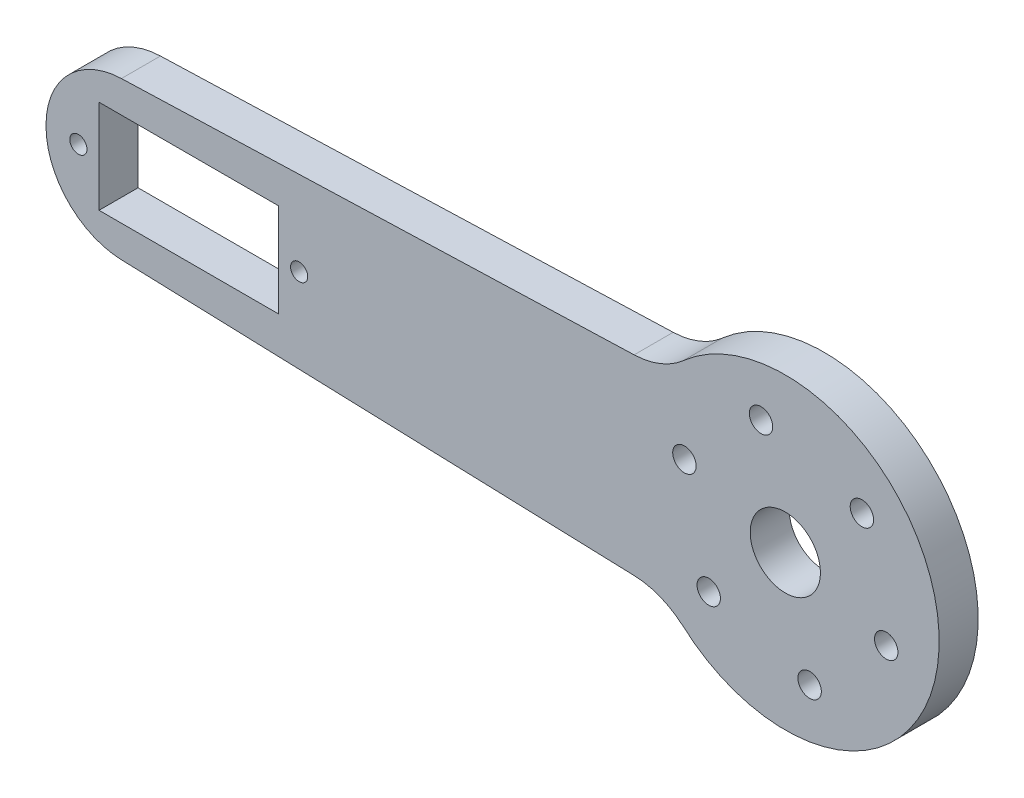
ISO-10303-21;
HEADER;
FILE_DESCRIPTION(('STEP AP214'),'2;1');
FILE_NAME('part.step','',(''),(''),'','','');
FILE_SCHEMA(('AUTOMOTIVE_DESIGN { 1 0 10303 214 1 1 1 1 }'));
ENDSEC;
DATA;
#1=APPLICATION_CONTEXT('core data for automotive mechanical design processes');
#2=APPLICATION_PROTOCOL_DEFINITION('international standard','automotive_design',2000,#1);
#3=PRODUCT_CONTEXT('',#1,'mechanical');
#4=PRODUCT('Part','Part','',(#3));
#5=PRODUCT_RELATED_PRODUCT_CATEGORY('part','',(#4));
#6=PRODUCT_DEFINITION_FORMATION('','',#4);
#7=PRODUCT_DEFINITION_CONTEXT('part definition',#1,'design');
#8=PRODUCT_DEFINITION('design','',#6,#7);
#9=PRODUCT_DEFINITION_SHAPE('','',#8);
#10=(LENGTH_UNIT() NAMED_UNIT(*) SI_UNIT(.MILLI.,.METRE.));
#11=(NAMED_UNIT(*) PLANE_ANGLE_UNIT() SI_UNIT($,.RADIAN.));
#12=(NAMED_UNIT(*) SI_UNIT($,.STERADIAN.) SOLID_ANGLE_UNIT());
#13=UNCERTAINTY_MEASURE_WITH_UNIT(LENGTH_MEASURE(1.E-05),#10,'distance_accuracy_value','');
#14=(GEOMETRIC_REPRESENTATION_CONTEXT(3) GLOBAL_UNCERTAINTY_ASSIGNED_CONTEXT((#13)) GLOBAL_UNIT_ASSIGNED_CONTEXT((#10,
#11,#12)) REPRESENTATION_CONTEXT('',''));
#15=CARTESIAN_POINT('',(0.,0.,0.));
#16=DIRECTION('',(0.,0.,1.));
#17=DIRECTION('',(1.,0.,0.));
#18=AXIS2_PLACEMENT_3D('',#15,#16,#17);
#19=CARTESIAN_POINT('',(0.,0.,5.));
#20=DIRECTION('',(0.,0.,1.));
#21=DIRECTION('',(1.,0.,0.));
#22=AXIS2_PLACEMENT_3D('',#19,#20,#21);
#23=PLANE('',#22);
#24=CARTESIAN_POINT('',(-46.8297385620915,0.,5.));
#25=DIRECTION('',(0.,0.,1.));
#26=DIRECTION('',(1.,0.,0.));
#27=AXIS2_PLACEMENT_3D('',#24,#25,#26);
#28=CIRCLE('',#27,1.1);
#29=CARTESIAN_POINT('',(-45.7297385620915,0.,5.));
#30=VERTEX_POINT('',#29);
#31=EDGE_CURVE('E291',#30,#30,#28,.T.);
#32=ORIENTED_EDGE('',*,*,#31,.F.);
#33=EDGE_LOOP('',(#32));
#34=FACE_BOUND('',#33,.T.);
#35=CARTESIAN_POINT('',(-18.5297385620915,0.,5.));
#36=DIRECTION('',(0.,0.,1.));
#37=DIRECTION('',(-1.,0.,0.));
#38=AXIS2_PLACEMENT_3D('',#35,#36,#37);
#39=CIRCLE('',#38,1.1);
#40=CARTESIAN_POINT('',(-19.6297385620915,0.,5.));
#41=VERTEX_POINT('',#40);
#42=EDGE_CURVE('E300',#41,#41,#39,.T.);
#43=ORIENTED_EDGE('',*,*,#42,.F.);
#44=EDGE_LOOP('',(#43));
#45=FACE_BOUND('',#44,.T.);
#46=CARTESIAN_POINT('',(56.7245945855578,-3.86888130370243,5.));
#47=DIRECTION('',(0.,0.,1.));
#48=DIRECTION('',(1.,0.,0.));
#49=AXIS2_PLACEMENT_3D('',#46,#47,#48);
#50=CIRCLE('',#49,1.50000000000001);
#51=CARTESIAN_POINT('',(58.2245945855578,-3.86888130370243,5.));
#52=VERTEX_POINT('',#51);
#53=EDGE_CURVE('E317',#52,#52,#50,.T.);
#54=ORIENTED_EDGE('',*,*,#53,.F.);
#55=EDGE_LOOP('',(#54));
#56=FACE_BOUND('',#55,.T.);
#57=CARTESIAN_POINT('',(46.9071726361478,-13.1353923120184,5.));
#58=DIRECTION('',(0.,0.,1.));
#59=DIRECTION('',(1.,0.,0.));
#60=AXIS2_PLACEMENT_3D('',#57,#58,#59);
#61=CIRCLE('',#60,1.50000000000001);
#62=CARTESIAN_POINT('',(48.4071726361478,-13.1353923120184,5.));
#63=VERTEX_POINT('',#62);
#64=EDGE_CURVE('E321',#63,#63,#61,.T.);
#65=ORIENTED_EDGE('',*,*,#64,.F.);
#66=EDGE_LOOP('',(#65));
#67=FACE_BOUND('',#66,.T.);
#68=CARTESIAN_POINT('',(33.9734277237929,-9.26651100831639,5.));
#69=DIRECTION('',(0.,0.,1.));
#70=DIRECTION('',(1.,0.,0.));
#71=AXIS2_PLACEMENT_3D('',#68,#69,#70);
#72=CIRCLE('',#71,1.50000000000001);
#73=CARTESIAN_POINT('',(35.4734277237929,-9.26651100831639,5.));
#74=VERTEX_POINT('',#73);
#75=EDGE_CURVE('E313',#74,#74,#72,.T.);
#76=ORIENTED_EDGE('',*,*,#75,.F.);
#77=EDGE_LOOP('',(#76));
#78=FACE_BOUND('',#77,.T.);
#79=CARTESIAN_POINT('',(30.8571047608481,3.86888130370171,5.));
#80=DIRECTION('',(0.,0.,1.));
#81=DIRECTION('',(1.,0.,0.));
#82=AXIS2_PLACEMENT_3D('',#79,#80,#81);
#83=CIRCLE('',#82,1.49999999999999);
#84=CARTESIAN_POINT('',(32.3571047608481,3.86888130370171,5.));
#85=VERTEX_POINT('',#84);
#86=EDGE_CURVE('E309',#85,#85,#83,.T.);
#87=ORIENTED_EDGE('',*,*,#86,.F.);
#88=EDGE_LOOP('',(#87));
#89=FACE_BOUND('',#88,.T.);
#90=CARTESIAN_POINT('',(40.6745267102583,13.1353923120177,5.));
#91=DIRECTION('',(0.,0.,1.));
#92=DIRECTION('',(1.,0.,0.));
#93=AXIS2_PLACEMENT_3D('',#90,#91,#92);
#94=CIRCLE('',#93,1.50000000000001);
#95=CARTESIAN_POINT('',(42.1745267102583,13.1353923120177,5.));
#96=VERTEX_POINT('',#95);
#97=EDGE_CURVE('E298',#96,#96,#94,.T.);
#98=ORIENTED_EDGE('',*,*,#97,.F.);
#99=EDGE_LOOP('',(#98));
#100=FACE_BOUND('',#99,.T.);
#101=CARTESIAN_POINT('',(53.608271622613,9.26651100831564,5.));
#102=DIRECTION('',(0.,0.,1.));
#103=DIRECTION('',(1.,0.,0.));
#104=AXIS2_PLACEMENT_3D('',#101,#102,#103);
#105=CIRCLE('',#104,1.5);
#106=CARTESIAN_POINT('',(55.108271622613,9.26651100831564,5.));
#107=VERTEX_POINT('',#106);
#108=EDGE_CURVE('E269',#107,#107,#105,.T.);
#109=ORIENTED_EDGE('',*,*,#108,.F.);
#110=EDGE_LOOP('',(#109));
#111=FACE_BOUND('',#110,.T.);
#112=CARTESIAN_POINT('',(43.7908496732026,0.,5.));
#113=DIRECTION('',(0.,0.,1.));
#114=DIRECTION('',(1.,0.,0.));
#115=AXIS2_PLACEMENT_3D('',#112,#113,#114);
#116=CIRCLE('',#115,4.5);
#117=CARTESIAN_POINT('',(48.2908496732026,0.,5.));
#118=VERTEX_POINT('',#117);
#119=EDGE_CURVE('E263',#118,#118,#116,.T.);
#120=ORIENTED_EDGE('',*,*,#119,.F.);
#121=EDGE_LOOP('',(#120));
#122=FACE_BOUND('',#121,.T.);
#123=DIRECTION('',(-0.999444906979154,-0.0333148302326385,0.));
#124=VECTOR('',#123,1.);
#125=CARTESIAN_POINT('',(49.0196078431373,13.0718954248366,5.));
#126=LINE('',#125,#124);
#127=CARTESIAN_POINT('',(24.4128324046,12.2516695768854,5.));
#128=VERTEX_POINT('',#127);
#129=CARTESIAN_POINT('',(-41.3135404591891,10.0607904814257,5.));
#130=VERTEX_POINT('',#129);
#131=EDGE_CURVE('E199',#128,#130,#126,.T.);
#132=ORIENTED_EDGE('',*,*,#131,.T.);
#133=CARTESIAN_POINT('',(-40.9803921568627,0.0663414116341774,5.));
#134=DIRECTION('',(0.,0.,1.));
#135=DIRECTION('',(1.,0.,0.));
#136=AXIS2_PLACEMENT_3D('',#133,#134,#135);
#137=CIRCLE('',#136,10.);
#138=CARTESIAN_POINT('',(-50.9803921568627,0.0663414116341774,5.));
#139=VERTEX_POINT('',#138);
#140=EDGE_CURVE('E233',#130,#139,#137,.T.);
#141=ORIENTED_EDGE('',*,*,#140,.T.);
#142=DIRECTION('',(0.,-1.,0.));
#143=VECTOR('',#142,1.);
#144=CARTESIAN_POINT('',(-50.9803921568627,9.80392156862745,5.));
#145=LINE('',#144,#143);
#146=CARTESIAN_POINT('',(-50.9803921568627,-0.0663414116341809,5.));
#147=VERTEX_POINT('',#146);
#148=EDGE_CURVE('E192',#139,#147,#145,.T.);
#149=ORIENTED_EDGE('',*,*,#148,.T.);
#150=CARTESIAN_POINT('',(-40.9803921568627,-0.0663414116341804,5.));
#151=DIRECTION('',(0.,0.,1.));
#152=DIRECTION('',(1.,0.,0.));
#153=AXIS2_PLACEMENT_3D('',#150,#151,#152);
#154=CIRCLE('',#153,10.);
#155=CARTESIAN_POINT('',(-41.3135404591891,-10.0607904814257,5.));
#156=VERTEX_POINT('',#155);
#157=EDGE_CURVE('E67',#147,#156,#154,.T.);
#158=ORIENTED_EDGE('',*,*,#157,.T.);
#159=DIRECTION('',(0.999444906979154,-0.0333148302326385,0.));
#160=VECTOR('',#159,1.);
#161=CARTESIAN_POINT('',(49.0196078431373,-13.0718954248366,5.));
#162=LINE('',#161,#160);
#163=CARTESIAN_POINT('',(24.4128324046,-12.2516695768854,5.));
#164=VERTEX_POINT('',#163);
#165=EDGE_CURVE('E195',#156,#164,#162,.T.);
#166=ORIENTED_EDGE('',*,*,#165,.T.);
#167=CARTESIAN_POINT('',(24.0796841022736,-22.2461186466769,5.));
#168=DIRECTION('',(0.,0.,1.));
#169=DIRECTION('',(1.,0.,0.));
#170=AXIS2_PLACEMENT_3D('',#167,#168,#169);
#171=CIRCLE('',#170,10.);
#172=CARTESIAN_POINT('',(30.7114430341046,-14.7614828191914,5.));
#173=VERTEX_POINT('',#172);
#174=EDGE_CURVE('E253',#164,#173,#171,.F.);
#175=ORIENTED_EDGE('',*,*,#174,.T.);
#176=CARTESIAN_POINT('',(43.7908496732026,0.,5.));
#177=DIRECTION('',(0.,0.,1.));
#178=DIRECTION('',(1.,0.,0.));
#179=AXIS2_PLACEMENT_3D('',#176,#177,#178);
#180=CIRCLE('',#179,19.722379497722);
#181=CARTESIAN_POINT('',(30.7114430341046,14.7614828191914,5.));
#182=VERTEX_POINT('',#181);
#183=EDGE_CURVE('E262',#173,#182,#180,.T.);
#184=ORIENTED_EDGE('',*,*,#183,.T.);
#185=CARTESIAN_POINT('',(24.0796841022736,22.2461186466769,5.));
#186=DIRECTION('',(0.,0.,1.));
#187=DIRECTION('',(1.,0.,0.));
#188=AXIS2_PLACEMENT_3D('',#185,#186,#187);
#189=CIRCLE('',#188,10.);
#190=EDGE_CURVE('E52',#182,#128,#189,.F.);
#191=ORIENTED_EDGE('',*,*,#190,.T.);
#192=EDGE_LOOP('',(#132,#141,#149,#158,#166,#175,#184,#191));
#193=FACE_BOUND('',#192,.T.);
#194=DIRECTION('',(-1.,0.,0.));
#195=VECTOR('',#194,1.);
#196=CARTESIAN_POINT('',(-44.1797385620915,6.,5.));
#197=LINE('',#196,#195);
#198=CARTESIAN_POINT('',(-21.1797385620915,6.,5.));
#199=VERTEX_POINT('',#198);
#200=CARTESIAN_POINT('',(-44.1797385620915,6.,5.));
#201=VERTEX_POINT('',#200);
#202=EDGE_CURVE('E147',#199,#201,#197,.T.);
#203=ORIENTED_EDGE('',*,*,#202,.F.);
#204=DIRECTION('',(0.,1.,0.));
#205=VECTOR('',#204,1.);
#206=CARTESIAN_POINT('',(-21.1797385620915,6.,5.));
#207=LINE('',#206,#205);
#208=CARTESIAN_POINT('',(-21.1797385620915,-6.,5.));
#209=VERTEX_POINT('',#208);
#210=EDGE_CURVE('E136',#209,#199,#207,.T.);
#211=ORIENTED_EDGE('',*,*,#210,.F.);
#212=DIRECTION('',(1.,0.,0.));
#213=VECTOR('',#212,1.);
#214=CARTESIAN_POINT('',(-44.1797385620915,-6.,5.));
#215=LINE('',#214,#213);
#216=CARTESIAN_POINT('',(-44.1797385620915,-6.,5.));
#217=VERTEX_POINT('',#216);
#218=EDGE_CURVE('E166',#217,#209,#215,.T.);
#219=ORIENTED_EDGE('',*,*,#218,.F.);
#220=DIRECTION('',(0.,-1.,0.));
#221=VECTOR('',#220,1.);
#222=CARTESIAN_POINT('',(-44.1797385620915,6.,5.));
#223=LINE('',#222,#221);
#224=EDGE_CURVE('E161',#201,#217,#223,.T.);
#225=ORIENTED_EDGE('',*,*,#224,.F.);
#226=EDGE_LOOP('',(#203,#211,#219,#225));
#227=FACE_BOUND('',#226,.T.);
#228=ADVANCED_FACE('F42',(#34,#45,#56,#67,#78,#89,#100,#111,#122,#193,#227),#23,.T.);
#229=CARTESIAN_POINT('',(0.,0.,0.));
#230=DIRECTION('',(0.,0.,1.));
#231=DIRECTION('',(1.,0.,0.));
#232=AXIS2_PLACEMENT_3D('',#229,#230,#231);
#233=PLANE('',#232);
#234=CARTESIAN_POINT('',(-46.8297385620915,0.,0.));
#235=DIRECTION('',(0.,0.,1.));
#236=DIRECTION('',(1.,0.,0.));
#237=AXIS2_PLACEMENT_3D('',#234,#235,#236);
#238=CIRCLE('',#237,1.1);
#239=CARTESIAN_POINT('',(-45.7297385620915,0.,0.));
#240=VERTEX_POINT('',#239);
#241=EDGE_CURVE('E46',#240,#240,#238,.T.);
#242=ORIENTED_EDGE('',*,*,#241,.T.);
#243=EDGE_LOOP('',(#242));
#244=FACE_BOUND('',#243,.T.);
#245=CARTESIAN_POINT('',(-18.5297385620915,0.,0.));
#246=DIRECTION('',(0.,0.,1.));
#247=DIRECTION('',(1.,0.,0.));
#248=AXIS2_PLACEMENT_3D('',#245,#246,#247);
#249=CIRCLE('',#248,1.1);
#250=CARTESIAN_POINT('',(-17.4297385620915,0.,0.));
#251=VERTEX_POINT('',#250);
#252=EDGE_CURVE('E288',#251,#251,#249,.T.);
#253=ORIENTED_EDGE('',*,*,#252,.T.);
#254=EDGE_LOOP('',(#253));
#255=FACE_BOUND('',#254,.T.);
#256=CARTESIAN_POINT('',(56.7245945855578,-3.86888130370243,0.));
#257=DIRECTION('',(0.,0.,1.));
#258=DIRECTION('',(1.,0.,0.));
#259=AXIS2_PLACEMENT_3D('',#256,#257,#258);
#260=CIRCLE('',#259,1.50000000000001);
#261=CARTESIAN_POINT('',(58.2245945855578,-3.86888130370243,0.));
#262=VERTEX_POINT('',#261);
#263=EDGE_CURVE('E285',#262,#262,#260,.T.);
#264=ORIENTED_EDGE('',*,*,#263,.T.);
#265=EDGE_LOOP('',(#264));
#266=FACE_BOUND('',#265,.T.);
#267=CARTESIAN_POINT('',(46.9071726361478,-13.1353923120184,0.));
#268=DIRECTION('',(0.,0.,1.));
#269=DIRECTION('',(1.,0.,0.));
#270=AXIS2_PLACEMENT_3D('',#267,#268,#269);
#271=CIRCLE('',#270,1.50000000000001);
#272=CARTESIAN_POINT('',(48.4071726361478,-13.1353923120184,0.));
#273=VERTEX_POINT('',#272);
#274=EDGE_CURVE('E281',#273,#273,#271,.T.);
#275=ORIENTED_EDGE('',*,*,#274,.T.);
#276=EDGE_LOOP('',(#275));
#277=FACE_BOUND('',#276,.T.);
#278=CARTESIAN_POINT('',(33.9734277237929,-9.26651100831639,0.));
#279=DIRECTION('',(0.,0.,1.));
#280=DIRECTION('',(1.,0.,0.));
#281=AXIS2_PLACEMENT_3D('',#278,#279,#280);
#282=CIRCLE('',#281,1.50000000000001);
#283=CARTESIAN_POINT('',(35.4734277237929,-9.26651100831639,0.));
#284=VERTEX_POINT('',#283);
#285=EDGE_CURVE('E277',#284,#284,#282,.T.);
#286=ORIENTED_EDGE('',*,*,#285,.T.);
#287=EDGE_LOOP('',(#286));
#288=FACE_BOUND('',#287,.T.);
#289=CARTESIAN_POINT('',(30.8571047608481,3.86888130370171,0.));
#290=DIRECTION('',(0.,0.,1.));
#291=DIRECTION('',(1.,0.,0.));
#292=AXIS2_PLACEMENT_3D('',#289,#290,#291);
#293=CIRCLE('',#292,1.49999999999999);
#294=CARTESIAN_POINT('',(32.3571047608481,3.86888130370171,0.));
#295=VERTEX_POINT('',#294);
#296=EDGE_CURVE('E273',#295,#295,#293,.T.);
#297=ORIENTED_EDGE('',*,*,#296,.T.);
#298=EDGE_LOOP('',(#297));
#299=FACE_BOUND('',#298,.T.);
#300=CARTESIAN_POINT('',(40.6745267102583,13.1353923120177,0.));
#301=DIRECTION('',(0.,0.,1.));
#302=DIRECTION('',(1.,0.,0.));
#303=AXIS2_PLACEMENT_3D('',#300,#301,#302);
#304=CIRCLE('',#303,1.50000000000001);
#305=CARTESIAN_POINT('',(42.1745267102583,13.1353923120177,0.));
#306=VERTEX_POINT('',#305);
#307=EDGE_CURVE('E268',#306,#306,#304,.T.);
#308=ORIENTED_EDGE('',*,*,#307,.T.);
#309=EDGE_LOOP('',(#308));
#310=FACE_BOUND('',#309,.T.);
#311=CARTESIAN_POINT('',(53.608271622613,9.26651100831564,0.));
#312=DIRECTION('',(0.,0.,1.));
#313=DIRECTION('',(1.,0.,0.));
#314=AXIS2_PLACEMENT_3D('',#311,#312,#313);
#315=CIRCLE('',#314,1.5);
#316=CARTESIAN_POINT('',(55.108271622613,9.26651100831564,0.));
#317=VERTEX_POINT('',#316);
#318=EDGE_CURVE('E264',#317,#317,#315,.T.);
#319=ORIENTED_EDGE('',*,*,#318,.T.);
#320=EDGE_LOOP('',(#319));
#321=FACE_BOUND('',#320,.T.);
#322=CARTESIAN_POINT('',(43.7908496732026,0.,0.));
#323=DIRECTION('',(0.,0.,1.));
#324=DIRECTION('',(1.,0.,0.));
#325=AXIS2_PLACEMENT_3D('',#322,#323,#324);
#326=CIRCLE('',#325,4.5);
#327=CARTESIAN_POINT('',(48.2908496732026,0.,0.));
#328=VERTEX_POINT('',#327);
#329=EDGE_CURVE('E258',#328,#328,#326,.T.);
#330=ORIENTED_EDGE('',*,*,#329,.T.);
#331=EDGE_LOOP('',(#330));
#332=FACE_BOUND('',#331,.T.);
#333=DIRECTION('',(0.,-1.,0.));
#334=VECTOR('',#333,1.);
#335=CARTESIAN_POINT('',(-50.9803921568627,9.80392156862745,0.));
#336=LINE('',#335,#334);
#337=CARTESIAN_POINT('',(-50.9803921568627,0.0663414116341774,0.));
#338=VERTEX_POINT('',#337);
#339=CARTESIAN_POINT('',(-50.9803921568627,-0.0663414116341809,0.));
#340=VERTEX_POINT('',#339);
#341=EDGE_CURVE('E156',#338,#340,#336,.T.);
#342=ORIENTED_EDGE('',*,*,#341,.F.);
#343=CARTESIAN_POINT('',(-40.9803921568627,0.0663414116341774,0.));
#344=DIRECTION('',(0.,0.,1.));
#345=DIRECTION('',(1.,0.,0.));
#346=AXIS2_PLACEMENT_3D('',#343,#344,#345);
#347=CIRCLE('',#346,10.);
#348=CARTESIAN_POINT('',(-41.3135404591891,10.0607904814257,0.));
#349=VERTEX_POINT('',#348);
#350=EDGE_CURVE('E222',#338,#349,#347,.F.);
#351=ORIENTED_EDGE('',*,*,#350,.T.);
#352=DIRECTION('',(-0.999444906979154,-0.0333148302326385,0.));
#353=VECTOR('',#352,1.);
#354=CARTESIAN_POINT('',(49.0196078431373,13.0718954248366,0.));
#355=LINE('',#354,#353);
#356=CARTESIAN_POINT('',(24.4128324046,12.2516695768854,0.));
#357=VERTEX_POINT('',#356);
#358=EDGE_CURVE('E196',#357,#349,#355,.T.);
#359=ORIENTED_EDGE('',*,*,#358,.F.);
#360=CARTESIAN_POINT('',(24.0796841022736,22.2461186466769,0.));
#361=DIRECTION('',(0.,0.,1.));
#362=DIRECTION('',(1.,0.,0.));
#363=AXIS2_PLACEMENT_3D('',#360,#361,#362);
#364=CIRCLE('',#363,10.);
#365=CARTESIAN_POINT('',(30.7114430341046,14.7614828191914,0.));
#366=VERTEX_POINT('',#365);
#367=EDGE_CURVE('E11',#357,#366,#364,.T.);
#368=ORIENTED_EDGE('',*,*,#367,.T.);
#369=CARTESIAN_POINT('',(43.7908496732026,0.,0.));
#370=DIRECTION('',(0.,0.,1.));
#371=DIRECTION('',(1.,0.,0.));
#372=AXIS2_PLACEMENT_3D('',#369,#370,#371);
#373=CIRCLE('',#372,19.722379497722);
#374=CARTESIAN_POINT('',(30.7114430341046,-14.7614828191914,0.));
#375=VERTEX_POINT('',#374);
#376=EDGE_CURVE('E175',#366,#375,#373,.F.);
#377=ORIENTED_EDGE('',*,*,#376,.T.);
#378=CARTESIAN_POINT('',(24.0796841022736,-22.2461186466769,0.));
#379=DIRECTION('',(0.,0.,1.));
#380=DIRECTION('',(1.,0.,0.));
#381=AXIS2_PLACEMENT_3D('',#378,#379,#380);
#382=CIRCLE('',#381,10.);
#383=CARTESIAN_POINT('',(24.4128324046,-12.2516695768854,0.));
#384=VERTEX_POINT('',#383);
#385=EDGE_CURVE('E250',#375,#384,#382,.T.);
#386=ORIENTED_EDGE('',*,*,#385,.T.);
#387=DIRECTION('',(0.999444906979154,-0.0333148302326385,0.));
#388=VECTOR('',#387,1.);
#389=CARTESIAN_POINT('',(49.0196078431373,-13.0718954248366,0.));
#390=LINE('',#389,#388);
#391=CARTESIAN_POINT('',(-41.3135404591891,-10.0607904814257,0.));
#392=VERTEX_POINT('',#391);
#393=EDGE_CURVE('E207',#392,#384,#390,.T.);
#394=ORIENTED_EDGE('',*,*,#393,.F.);
#395=CARTESIAN_POINT('',(-40.9803921568627,-0.0663414116341804,0.));
#396=DIRECTION('',(0.,0.,1.));
#397=DIRECTION('',(1.,0.,0.));
#398=AXIS2_PLACEMENT_3D('',#395,#396,#397);
#399=CIRCLE('',#398,10.);
#400=EDGE_CURVE('E219',#392,#340,#399,.F.);
#401=ORIENTED_EDGE('',*,*,#400,.T.);
#402=EDGE_LOOP('',(#342,#351,#359,#368,#377,#386,#394,#401));
#403=FACE_BOUND('',#402,.T.);
#404=DIRECTION('',(0.,1.,0.));
#405=VECTOR('',#404,1.);
#406=CARTESIAN_POINT('',(-21.1797385620915,6.,0.));
#407=LINE('',#406,#405);
#408=CARTESIAN_POINT('',(-21.1797385620915,-6.,0.));
#409=VERTEX_POINT('',#408);
#410=CARTESIAN_POINT('',(-21.1797385620915,6.,0.));
#411=VERTEX_POINT('',#410);
#412=EDGE_CURVE('E172',#409,#411,#407,.T.);
#413=ORIENTED_EDGE('',*,*,#412,.T.);
#414=DIRECTION('',(-1.,0.,0.));
#415=VECTOR('',#414,1.);
#416=CARTESIAN_POINT('',(-44.1797385620915,6.,0.));
#417=LINE('',#416,#415);
#418=CARTESIAN_POINT('',(-44.1797385620915,6.,0.));
#419=VERTEX_POINT('',#418);
#420=EDGE_CURVE('E154',#411,#419,#417,.T.);
#421=ORIENTED_EDGE('',*,*,#420,.T.);
#422=DIRECTION('',(0.,-1.,0.));
#423=VECTOR('',#422,1.);
#424=CARTESIAN_POINT('',(-44.1797385620915,6.,0.));
#425=LINE('',#424,#423);
#426=CARTESIAN_POINT('',(-44.1797385620915,-6.,0.));
#427=VERTEX_POINT('',#426);
#428=EDGE_CURVE('E178',#419,#427,#425,.T.);
#429=ORIENTED_EDGE('',*,*,#428,.T.);
#430=DIRECTION('',(1.,0.,0.));
#431=VECTOR('',#430,1.);
#432=CARTESIAN_POINT('',(-44.1797385620915,-6.,0.));
#433=LINE('',#432,#431);
#434=EDGE_CURVE('E148',#427,#409,#433,.T.);
#435=ORIENTED_EDGE('',*,*,#434,.T.);
#436=EDGE_LOOP('',(#413,#421,#429,#435));
#437=FACE_BOUND('',#436,.T.);
#438=ADVANCED_FACE('F352',(#244,#255,#266,#277,#288,#299,#310,#321,#332,#403,#437),#233,.F.);
#439=CARTESIAN_POINT('',(-50.9803921568627,9.80392156862745,5.));
#440=DIRECTION('',(1.,0.,0.));
#441=DIRECTION('',(0.,0.,-1.));
#442=AXIS2_PLACEMENT_3D('',#439,#440,#441);
#443=PLANE('',#442);
#444=ORIENTED_EDGE('',*,*,#148,.F.);
#445=DIRECTION('',(0.,0.,-1.));
#446=VECTOR('',#445,1.);
#447=CARTESIAN_POINT('',(-50.9803921568627,0.0663414116341774,5.));
#448=LINE('',#447,#446);
#449=EDGE_CURVE('E215',#139,#338,#448,.T.);
#450=ORIENTED_EDGE('',*,*,#449,.T.);
#451=ORIENTED_EDGE('',*,*,#341,.T.);
#452=DIRECTION('',(0.,0.,-1.));
#453=VECTOR('',#452,1.);
#454=CARTESIAN_POINT('',(-50.9803921568627,-0.0663414116341809,5.));
#455=LINE('',#454,#453);
#456=EDGE_CURVE('E203',#340,#147,#455,.F.);
#457=ORIENTED_EDGE('',*,*,#456,.T.);
#458=EDGE_LOOP('',(#444,#450,#451,#457));
#459=FACE_BOUND('',#458,.T.);
#460=ADVANCED_FACE('F361',(#459),#443,.F.);
#461=CARTESIAN_POINT('',(49.0196078431373,-13.0718954248366,5.));
#462=DIRECTION('',(0.0333148302326385,0.999444906979154,0.));
#463=DIRECTION('',(-0.999444906979154,0.0333148302326385,0.));
#464=AXIS2_PLACEMENT_3D('',#461,#462,#463);
#465=PLANE('',#464);
#466=ORIENTED_EDGE('',*,*,#165,.F.);
#467=DIRECTION('',(0.,0.,-1.));
#468=VECTOR('',#467,1.);
#469=CARTESIAN_POINT('',(-41.3135404591891,-10.0607904814257,5.));
#470=LINE('',#469,#468);
#471=EDGE_CURVE('E238',#156,#392,#470,.T.);
#472=ORIENTED_EDGE('',*,*,#471,.T.);
#473=ORIENTED_EDGE('',*,*,#393,.T.);
#474=DIRECTION('',(0.,0.,1.));
#475=VECTOR('',#474,1.);
#476=CARTESIAN_POINT('',(24.4128324046,-12.2516695768854,5.));
#477=LINE('',#476,#475);
#478=EDGE_CURVE('E60',#384,#164,#477,.T.);
#479=ORIENTED_EDGE('',*,*,#478,.T.);
#480=EDGE_LOOP('',(#466,#472,#473,#479));
#481=FACE_BOUND('',#480,.T.);
#482=ADVANCED_FACE('F354',(#481),#465,.F.);
#483=CARTESIAN_POINT('',(49.0196078431373,13.0718954248366,5.));
#484=DIRECTION('',(0.0333148302326385,-0.999444906979154,0.));
#485=DIRECTION('',(0.999444906979154,0.0333148302326385,0.));
#486=AXIS2_PLACEMENT_3D('',#483,#484,#485);
#487=PLANE('',#486);
#488=ORIENTED_EDGE('',*,*,#358,.T.);
#489=DIRECTION('',(0.,0.,-1.));
#490=VECTOR('',#489,1.);
#491=CARTESIAN_POINT('',(-41.3135404591891,10.0607904814257,5.));
#492=LINE('',#491,#490);
#493=EDGE_CURVE('E228',#349,#130,#492,.F.);
#494=ORIENTED_EDGE('',*,*,#493,.T.);
#495=ORIENTED_EDGE('',*,*,#131,.F.);
#496=DIRECTION('',(0.,0.,1.));
#497=VECTOR('',#496,1.);
#498=CARTESIAN_POINT('',(24.4128324046,12.2516695768854,5.));
#499=LINE('',#498,#497);
#500=EDGE_CURVE('E225',#128,#357,#499,.F.);
#501=ORIENTED_EDGE('',*,*,#500,.T.);
#502=EDGE_LOOP('',(#488,#494,#495,#501));
#503=FACE_BOUND('',#502,.T.);
#504=ADVANCED_FACE('F370',(#503),#487,.F.);
#505=CARTESIAN_POINT('',(-21.1797385620915,6.,5.));
#506=DIRECTION('',(-1.,0.,0.));
#507=DIRECTION('',(0.,-1.,0.));
#508=AXIS2_PLACEMENT_3D('',#505,#506,#507);
#509=PLANE('',#508);
#510=ORIENTED_EDGE('',*,*,#412,.F.);
#511=DIRECTION('',(0.,0.,-1.));
#512=VECTOR('',#511,1.);
#513=CARTESIAN_POINT('',(-21.1797385620915,-6.,5.));
#514=LINE('',#513,#512);
#515=EDGE_CURVE('E142',#209,#409,#514,.T.);
#516=ORIENTED_EDGE('',*,*,#515,.F.);
#517=ORIENTED_EDGE('',*,*,#210,.T.);
#518=DIRECTION('',(0.,0.,-1.));
#519=VECTOR('',#518,1.);
#520=CARTESIAN_POINT('',(-21.1797385620915,6.,5.));
#521=LINE('',#520,#519);
#522=EDGE_CURVE('E139',#199,#411,#521,.T.);
#523=ORIENTED_EDGE('',*,*,#522,.T.);
#524=EDGE_LOOP('',(#510,#516,#517,#523));
#525=FACE_BOUND('',#524,.T.);
#526=ADVANCED_FACE('F138',(#525),#509,.T.);
#527=CARTESIAN_POINT('',(-44.1797385620915,6.,5.));
#528=DIRECTION('',(0.,-1.,0.));
#529=DIRECTION('',(0.,0.,-1.));
#530=AXIS2_PLACEMENT_3D('',#527,#528,#529);
#531=PLANE('',#530);
#532=ORIENTED_EDGE('',*,*,#420,.F.);
#533=ORIENTED_EDGE('',*,*,#522,.F.);
#534=ORIENTED_EDGE('',*,*,#202,.T.);
#535=DIRECTION('',(0.,0.,-1.));
#536=VECTOR('',#535,1.);
#537=CARTESIAN_POINT('',(-44.1797385620915,6.,5.));
#538=LINE('',#537,#536);
#539=EDGE_CURVE('E157',#201,#419,#538,.T.);
#540=ORIENTED_EDGE('',*,*,#539,.T.);
#541=EDGE_LOOP('',(#532,#533,#534,#540));
#542=FACE_BOUND('',#541,.T.);
#543=ADVANCED_FACE('F151',(#542),#531,.T.);
#544=CARTESIAN_POINT('',(-44.1797385620915,6.,5.));
#545=DIRECTION('',(1.,0.,0.));
#546=DIRECTION('',(0.,0.,-1.));
#547=AXIS2_PLACEMENT_3D('',#544,#545,#546);
#548=PLANE('',#547);
#549=ORIENTED_EDGE('',*,*,#428,.F.);
#550=ORIENTED_EDGE('',*,*,#539,.F.);
#551=ORIENTED_EDGE('',*,*,#224,.T.);
#552=DIRECTION('',(0.,0.,-1.));
#553=VECTOR('',#552,1.);
#554=CARTESIAN_POINT('',(-44.1797385620915,-6.,5.));
#555=LINE('',#554,#553);
#556=EDGE_CURVE('E187',#217,#427,#555,.T.);
#557=ORIENTED_EDGE('',*,*,#556,.T.);
#558=EDGE_LOOP('',(#549,#550,#551,#557));
#559=FACE_BOUND('',#558,.T.);
#560=ADVANCED_FACE('F568',(#559),#548,.T.);
#561=CARTESIAN_POINT('',(-44.1797385620915,-6.,5.));
#562=DIRECTION('',(0.,1.,0.));
#563=DIRECTION('',(0.,0.,1.));
#564=AXIS2_PLACEMENT_3D('',#561,#562,#563);
#565=PLANE('',#564);
#566=ORIENTED_EDGE('',*,*,#434,.F.);
#567=ORIENTED_EDGE('',*,*,#556,.F.);
#568=ORIENTED_EDGE('',*,*,#218,.T.);
#569=ORIENTED_EDGE('',*,*,#515,.T.);
#570=EDGE_LOOP('',(#566,#567,#568,#569));
#571=FACE_BOUND('',#570,.T.);
#572=ADVANCED_FACE('F542',(#571),#565,.T.);
#573=CARTESIAN_POINT('',(43.7908496732026,0.,-55.783313135895));
#574=DIRECTION('',(0.,0.,1.));
#575=DIRECTION('',(1.,0.,0.));
#576=AXIS2_PLACEMENT_3D('',#573,#574,#575);
#577=CYLINDRICAL_SURFACE('',#576,19.722379497722);
#578=ORIENTED_EDGE('',*,*,#183,.F.);
#579=DIRECTION('',(0.,0.,1.));
#580=VECTOR('',#579,1.);
#581=CARTESIAN_POINT('',(30.7114430341046,-14.7614828191914,-55.783313135895));
#582=LINE('',#581,#580);
#583=EDGE_CURVE('E246',#173,#375,#582,.F.);
#584=ORIENTED_EDGE('',*,*,#583,.T.);
#585=ORIENTED_EDGE('',*,*,#376,.F.);
#586=DIRECTION('',(0.,0.,1.));
#587=VECTOR('',#586,1.);
#588=CARTESIAN_POINT('',(30.7114430341046,14.7614828191914,-55.783313135895));
#589=LINE('',#588,#587);
#590=EDGE_CURVE('E242',#366,#182,#589,.T.);
#591=ORIENTED_EDGE('',*,*,#590,.T.);
#592=EDGE_LOOP('',(#578,#584,#585,#591));
#593=FACE_BOUND('',#592,.T.);
#594=ADVANCED_FACE('F344',(#593),#577,.T.);
#595=CARTESIAN_POINT('',(-40.9803921568627,0.0663414116341774,5.));
#596=DIRECTION('',(0.,0.,-1.));
#597=DIRECTION('',(-1.,0.,0.));
#598=AXIS2_PLACEMENT_3D('',#595,#596,#597);
#599=CYLINDRICAL_SURFACE('',#598,10.);
#600=ORIENTED_EDGE('',*,*,#140,.F.);
#601=ORIENTED_EDGE('',*,*,#493,.F.);
#602=ORIENTED_EDGE('',*,*,#350,.F.);
#603=ORIENTED_EDGE('',*,*,#449,.F.);
#604=EDGE_LOOP('',(#600,#601,#602,#603));
#605=FACE_BOUND('',#604,.T.);
#606=ADVANCED_FACE('F365',(#605),#599,.T.);
#607=CARTESIAN_POINT('',(-40.9803921568627,-0.0663414116341804,5.));
#608=DIRECTION('',(0.,0.,-1.));
#609=DIRECTION('',(-1.,0.,0.));
#610=AXIS2_PLACEMENT_3D('',#607,#608,#609);
#611=CYLINDRICAL_SURFACE('',#610,10.);
#612=ORIENTED_EDGE('',*,*,#157,.F.);
#613=ORIENTED_EDGE('',*,*,#456,.F.);
#614=ORIENTED_EDGE('',*,*,#400,.F.);
#615=ORIENTED_EDGE('',*,*,#471,.F.);
#616=EDGE_LOOP('',(#612,#613,#614,#615));
#617=FACE_BOUND('',#616,.T.);
#618=ADVANCED_FACE('F357',(#617),#611,.T.);
#619=CARTESIAN_POINT('',(24.0796841022736,-22.2461186466769,-55.783313135895));
#620=DIRECTION('',(0.,0.,1.));
#621=DIRECTION('',(1.,0.,0.));
#622=AXIS2_PLACEMENT_3D('',#619,#620,#621);
#623=CYLINDRICAL_SURFACE('',#622,10.);
#624=ORIENTED_EDGE('',*,*,#174,.F.);
#625=ORIENTED_EDGE('',*,*,#478,.F.);
#626=ORIENTED_EDGE('',*,*,#385,.F.);
#627=ORIENTED_EDGE('',*,*,#583,.F.);
#628=EDGE_LOOP('',(#624,#625,#626,#627));
#629=FACE_BOUND('',#628,.T.);
#630=ADVANCED_FACE('F348',(#629),#623,.F.);
#631=CARTESIAN_POINT('',(24.0796841022736,22.2461186466769,-55.783313135895));
#632=DIRECTION('',(0.,0.,1.));
#633=DIRECTION('',(1.,0.,0.));
#634=AXIS2_PLACEMENT_3D('',#631,#632,#633);
#635=CYLINDRICAL_SURFACE('',#634,10.);
#636=ORIENTED_EDGE('',*,*,#367,.F.);
#637=ORIENTED_EDGE('',*,*,#500,.F.);
#638=ORIENTED_EDGE('',*,*,#190,.F.);
#639=ORIENTED_EDGE('',*,*,#590,.F.);
#640=EDGE_LOOP('',(#636,#637,#638,#639));
#641=FACE_BOUND('',#640,.T.);
#642=ADVANCED_FACE('F44',(#641),#635,.F.);
#643=CARTESIAN_POINT('',(43.7908496732026,0.,-0.999999999999998));
#644=DIRECTION('',(0.,0.,1.));
#645=DIRECTION('',(1.,0.,0.));
#646=AXIS2_PLACEMENT_3D('',#643,#644,#645);
#647=CYLINDRICAL_SURFACE('',#646,4.5);
#648=ORIENTED_EDGE('',*,*,#119,.T.);
#649=EDGE_LOOP('',(#648));
#650=FACE_BOUND('',#649,.T.);
#651=ORIENTED_EDGE('',*,*,#329,.F.);
#652=EDGE_LOOP('',(#651));
#653=FACE_BOUND('',#652,.T.);
#654=ADVANCED_FACE('F374',(#650,#653),#647,.F.);
#655=CARTESIAN_POINT('',(53.608271622613,9.26651100831564,-5.));
#656=DIRECTION('',(0.,0.,1.));
#657=DIRECTION('',(1.,0.,0.));
#658=AXIS2_PLACEMENT_3D('',#655,#656,#657);
#659=CYLINDRICAL_SURFACE('',#658,1.5);
#660=ORIENTED_EDGE('',*,*,#108,.T.);
#661=EDGE_LOOP('',(#660));
#662=FACE_BOUND('',#661,.T.);
#663=ORIENTED_EDGE('',*,*,#318,.F.);
#664=EDGE_LOOP('',(#663));
#665=FACE_BOUND('',#664,.T.);
#666=ADVANCED_FACE('F379',(#662,#665),#659,.F.);
#667=CARTESIAN_POINT('',(40.6745267102583,13.1353923120177,-5.));
#668=DIRECTION('',(0.,0.,1.));
#669=DIRECTION('',(1.,0.,0.));
#670=AXIS2_PLACEMENT_3D('',#667,#668,#669);
#671=CYLINDRICAL_SURFACE('',#670,1.50000000000001);
#672=ORIENTED_EDGE('',*,*,#97,.T.);
#673=EDGE_LOOP('',(#672));
#674=FACE_BOUND('',#673,.T.);
#675=ORIENTED_EDGE('',*,*,#307,.F.);
#676=EDGE_LOOP('',(#675));
#677=FACE_BOUND('',#676,.T.);
#678=ADVANCED_FACE('F431',(#674,#677),#671,.F.);
#679=CARTESIAN_POINT('',(30.8571047608481,3.86888130370171,-5.));
#680=DIRECTION('',(0.,0.,1.));
#681=DIRECTION('',(1.,0.,0.));
#682=AXIS2_PLACEMENT_3D('',#679,#680,#681);
#683=CYLINDRICAL_SURFACE('',#682,1.49999999999999);
#684=ORIENTED_EDGE('',*,*,#86,.T.);
#685=EDGE_LOOP('',(#684));
#686=FACE_BOUND('',#685,.T.);
#687=ORIENTED_EDGE('',*,*,#296,.F.);
#688=EDGE_LOOP('',(#687));
#689=FACE_BOUND('',#688,.T.);
#690=ADVANCED_FACE('F441',(#686,#689),#683,.F.);
#691=CARTESIAN_POINT('',(33.9734277237929,-9.26651100831639,-5.));
#692=DIRECTION('',(0.,0.,1.));
#693=DIRECTION('',(1.,0.,0.));
#694=AXIS2_PLACEMENT_3D('',#691,#692,#693);
#695=CYLINDRICAL_SURFACE('',#694,1.50000000000001);
#696=ORIENTED_EDGE('',*,*,#75,.T.);
#697=EDGE_LOOP('',(#696));
#698=FACE_BOUND('',#697,.T.);
#699=ORIENTED_EDGE('',*,*,#285,.F.);
#700=EDGE_LOOP('',(#699));
#701=FACE_BOUND('',#700,.T.);
#702=ADVANCED_FACE('F451',(#698,#701),#695,.F.);
#703=CARTESIAN_POINT('',(46.9071726361478,-13.1353923120184,-5.));
#704=DIRECTION('',(0.,0.,1.));
#705=DIRECTION('',(1.,0.,0.));
#706=AXIS2_PLACEMENT_3D('',#703,#704,#705);
#707=CYLINDRICAL_SURFACE('',#706,1.50000000000001);
#708=ORIENTED_EDGE('',*,*,#64,.T.);
#709=EDGE_LOOP('',(#708));
#710=FACE_BOUND('',#709,.T.);
#711=ORIENTED_EDGE('',*,*,#274,.F.);
#712=EDGE_LOOP('',(#711));
#713=FACE_BOUND('',#712,.T.);
#714=ADVANCED_FACE('F461',(#710,#713),#707,.F.);
#715=CARTESIAN_POINT('',(56.7245945855578,-3.86888130370243,-5.));
#716=DIRECTION('',(0.,0.,1.));
#717=DIRECTION('',(1.,0.,0.));
#718=AXIS2_PLACEMENT_3D('',#715,#716,#717);
#719=CYLINDRICAL_SURFACE('',#718,1.50000000000001);
#720=ORIENTED_EDGE('',*,*,#53,.T.);
#721=EDGE_LOOP('',(#720));
#722=FACE_BOUND('',#721,.T.);
#723=ORIENTED_EDGE('',*,*,#263,.F.);
#724=EDGE_LOOP('',(#723));
#725=FACE_BOUND('',#724,.T.);
#726=ADVANCED_FACE('F471',(#722,#725),#719,.F.);
#727=CARTESIAN_POINT('',(-18.5297385620915,0.,-5.));
#728=DIRECTION('',(0.,0.,1.));
#729=DIRECTION('',(1.,0.,0.));
#730=AXIS2_PLACEMENT_3D('',#727,#728,#729);
#731=CYLINDRICAL_SURFACE('',#730,1.1);
#732=ORIENTED_EDGE('',*,*,#42,.T.);
#733=EDGE_LOOP('',(#732));
#734=FACE_BOUND('',#733,.T.);
#735=ORIENTED_EDGE('',*,*,#252,.F.);
#736=EDGE_LOOP('',(#735));
#737=FACE_BOUND('',#736,.T.);
#738=ADVANCED_FACE('F481',(#734,#737),#731,.F.);
#739=CARTESIAN_POINT('',(-46.8297385620915,0.,-5.));
#740=DIRECTION('',(0.,0.,1.));
#741=DIRECTION('',(1.,0.,0.));
#742=AXIS2_PLACEMENT_3D('',#739,#740,#741);
#743=CYLINDRICAL_SURFACE('',#742,1.1);
#744=ORIENTED_EDGE('',*,*,#31,.T.);
#745=EDGE_LOOP('',(#744));
#746=FACE_BOUND('',#745,.T.);
#747=ORIENTED_EDGE('',*,*,#241,.F.);
#748=EDGE_LOOP('',(#747));
#749=FACE_BOUND('',#748,.T.);
#750=ADVANCED_FACE('F492',(#746,#749),#743,.F.);
#751=CLOSED_SHELL('',(#228,#438,#460,#482,#504,#526,#543,#560,#572,#594,#606,#618,#630,#642,
#654,#666,#678,#690,#702,#714,#726,#738,#750));
#752=MANIFOLD_SOLID_BREP('B2',#751);
#753=ADVANCED_BREP_SHAPE_REPRESENTATION('',(#18,#752),#14);
#754=SHAPE_DEFINITION_REPRESENTATION(#9,#753);
ENDSEC;
END-ISO-10303-21;
